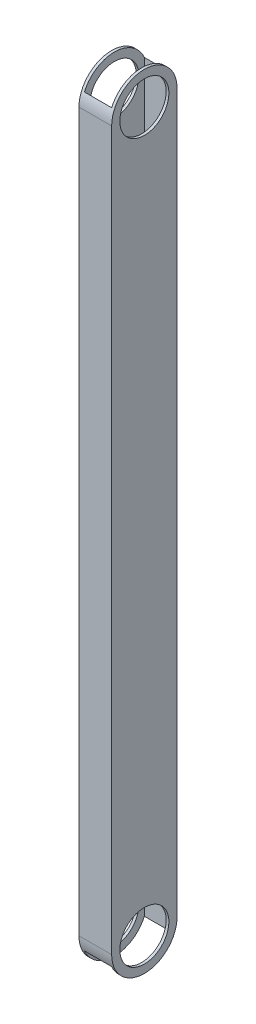
ISO-10303-21;
HEADER;
FILE_DESCRIPTION(('STEP AP214'),'2;1');
FILE_NAME('part.step','',(''),(''),'','','');
FILE_SCHEMA(('AUTOMOTIVE_DESIGN { 1 0 10303 214 1 1 1 1 }'));
ENDSEC;
DATA;
#1=APPLICATION_CONTEXT('core data for automotive mechanical design processes');
#2=APPLICATION_PROTOCOL_DEFINITION('international standard','automotive_design',2000,#1);
#3=PRODUCT_CONTEXT('',#1,'mechanical');
#4=PRODUCT('Part','Part','',(#3));
#5=PRODUCT_RELATED_PRODUCT_CATEGORY('part','',(#4));
#6=PRODUCT_DEFINITION_FORMATION('','',#4);
#7=PRODUCT_DEFINITION_CONTEXT('part definition',#1,'design');
#8=PRODUCT_DEFINITION('design','',#6,#7);
#9=PRODUCT_DEFINITION_SHAPE('','',#8);
#10=(LENGTH_UNIT() NAMED_UNIT(*) SI_UNIT(.MILLI.,.METRE.));
#11=(NAMED_UNIT(*) PLANE_ANGLE_UNIT() SI_UNIT($,.RADIAN.));
#12=(NAMED_UNIT(*) SI_UNIT($,.STERADIAN.) SOLID_ANGLE_UNIT());
#13=UNCERTAINTY_MEASURE_WITH_UNIT(LENGTH_MEASURE(1.E-05),#10,'distance_accuracy_value','');
#14=(GEOMETRIC_REPRESENTATION_CONTEXT(3) GLOBAL_UNCERTAINTY_ASSIGNED_CONTEXT((#13)) GLOBAL_UNIT_ASSIGNED_CONTEXT((#10,
#11,#12)) REPRESENTATION_CONTEXT('',''));
#15=CARTESIAN_POINT('',(0.,0.,0.));
#16=DIRECTION('',(0.,0.,1.));
#17=DIRECTION('',(1.,0.,0.));
#18=AXIS2_PLACEMENT_3D('',#15,#16,#17);
#19=CARTESIAN_POINT('',(0.,456.184,0.));
#20=DIRECTION('',(1.,0.,0.));
#21=DIRECTION('',(0.,0.,-1.));
#22=AXIS2_PLACEMENT_3D('',#19,#20,#21);
#23=PLANE('',#22);
#24=CARTESIAN_POINT('',(0.,437.134,-19.05));
#25=DIRECTION('',(-1.,0.,0.));
#26=DIRECTION('',(0.,0.,1.));
#27=AXIS2_PLACEMENT_3D('',#24,#25,#26);
#28=CIRCLE('',#27,14.2875);
#29=CARTESIAN_POINT('',(0.,437.134,-4.76250000000001));
#30=VERTEX_POINT('',#29);
#31=EDGE_CURVE('E216',#30,#30,#28,.T.);
#32=ORIENTED_EDGE('',*,*,#31,.F.);
#33=EDGE_LOOP('',(#32));
#34=FACE_BOUND('',#33,.T.);
#35=CARTESIAN_POINT('',(0.,19.05,-19.05));
#36=DIRECTION('',(-1.,0.,0.));
#37=DIRECTION('',(0.,0.,1.));
#38=AXIS2_PLACEMENT_3D('',#35,#36,#37);
#39=CIRCLE('',#38,14.2875);
#40=CARTESIAN_POINT('',(0.,19.05,-4.7625));
#41=VERTEX_POINT('',#40);
#42=EDGE_CURVE('E240',#41,#41,#39,.T.);
#43=ORIENTED_EDGE('',*,*,#42,.F.);
#44=EDGE_LOOP('',(#43));
#45=FACE_BOUND('',#44,.T.);
#46=DIRECTION('',(0.,-1.,0.));
#47=VECTOR('',#46,1.);
#48=CARTESIAN_POINT('',(0.,456.184,0.));
#49=LINE('',#48,#47);
#50=CARTESIAN_POINT('',(0.,437.134,0.));
#51=VERTEX_POINT('',#50);
#52=CARTESIAN_POINT('',(0.,19.05,0.));
#53=VERTEX_POINT('',#52);
#54=EDGE_CURVE('E191',#51,#53,#49,.T.);
#55=ORIENTED_EDGE('',*,*,#54,.F.);
#56=CARTESIAN_POINT('',(0.,437.134,-19.05));
#57=DIRECTION('',(-1.,0.,0.));
#58=DIRECTION('',(0.,0.,1.));
#59=AXIS2_PLACEMENT_3D('',#56,#57,#58);
#60=CIRCLE('',#59,19.05);
#61=CARTESIAN_POINT('',(0.,437.134,-38.1));
#62=VERTEX_POINT('',#61);
#63=EDGE_CURVE('E177',#51,#62,#60,.T.);
#64=ORIENTED_EDGE('',*,*,#63,.T.);
#65=DIRECTION('',(0.,-1.,0.));
#66=VECTOR('',#65,1.);
#67=CARTESIAN_POINT('',(0.,456.184,-38.1));
#68=LINE('',#67,#66);
#69=CARTESIAN_POINT('',(0.,19.05,-38.1));
#70=VERTEX_POINT('',#69);
#71=EDGE_CURVE('E195',#62,#70,#68,.T.);
#72=ORIENTED_EDGE('',*,*,#71,.T.);
#73=CARTESIAN_POINT('',(0.,19.05,-19.05));
#74=DIRECTION('',(-1.,0.,0.));
#75=DIRECTION('',(0.,0.,1.));
#76=AXIS2_PLACEMENT_3D('',#73,#74,#75);
#77=CIRCLE('',#76,19.05);
#78=EDGE_CURVE('E227',#70,#53,#77,.T.);
#79=ORIENTED_EDGE('',*,*,#78,.T.);
#80=EDGE_LOOP('',(#55,#64,#72,#79));
#81=FACE_BOUND('',#80,.T.);
#82=ADVANCED_FACE('F105',(#34,#45,#81),#23,.F.);
#83=CARTESIAN_POINT('',(19.05,456.184,0.));
#84=DIRECTION('',(-1.,0.,0.));
#85=DIRECTION('',(0.,0.,1.));
#86=AXIS2_PLACEMENT_3D('',#83,#84,#85);
#87=PLANE('',#86);
#88=CARTESIAN_POINT('',(19.05,437.134,-19.05));
#89=DIRECTION('',(-1.,0.,0.));
#90=DIRECTION('',(0.,0.,1.));
#91=AXIS2_PLACEMENT_3D('',#88,#89,#90);
#92=CIRCLE('',#91,14.2875);
#93=CARTESIAN_POINT('',(19.05,437.134,-4.76250000000001));
#94=VERTEX_POINT('',#93);
#95=EDGE_CURVE('E210',#94,#94,#92,.T.);
#96=ORIENTED_EDGE('',*,*,#95,.T.);
#97=EDGE_LOOP('',(#96));
#98=FACE_BOUND('',#97,.T.);
#99=CARTESIAN_POINT('',(19.05,19.05,-19.05));
#100=DIRECTION('',(-1.,0.,0.));
#101=DIRECTION('',(0.,0.,1.));
#102=AXIS2_PLACEMENT_3D('',#99,#100,#101);
#103=CIRCLE('',#102,14.2875);
#104=CARTESIAN_POINT('',(19.05,19.05,-4.7625));
#105=VERTEX_POINT('',#104);
#106=EDGE_CURVE('E203',#105,#105,#103,.T.);
#107=ORIENTED_EDGE('',*,*,#106,.T.);
#108=EDGE_LOOP('',(#107));
#109=FACE_BOUND('',#108,.T.);
#110=CARTESIAN_POINT('',(19.05,437.134,-19.05));
#111=DIRECTION('',(-1.,0.,0.));
#112=DIRECTION('',(0.,0.,1.));
#113=AXIS2_PLACEMENT_3D('',#110,#111,#112);
#114=CIRCLE('',#113,19.05);
#115=CARTESIAN_POINT('',(19.05,437.134,0.));
#116=VERTEX_POINT('',#115);
#117=CARTESIAN_POINT('',(19.05,437.134,-38.1));
#118=VERTEX_POINT('',#117);
#119=EDGE_CURVE('E119',#116,#118,#114,.T.);
#120=ORIENTED_EDGE('',*,*,#119,.F.);
#121=DIRECTION('',(0.,-1.,0.));
#122=VECTOR('',#121,1.);
#123=CARTESIAN_POINT('',(19.05,456.184,0.));
#124=LINE('',#123,#122);
#125=CARTESIAN_POINT('',(19.05,19.05,0.));
#126=VERTEX_POINT('',#125);
#127=EDGE_CURVE('E173',#116,#126,#124,.T.);
#128=ORIENTED_EDGE('',*,*,#127,.T.);
#129=CARTESIAN_POINT('',(19.05,19.05,-19.05));
#130=DIRECTION('',(-1.,0.,0.));
#131=DIRECTION('',(0.,0.,1.));
#132=AXIS2_PLACEMENT_3D('',#129,#130,#131);
#133=CIRCLE('',#132,19.05);
#134=CARTESIAN_POINT('',(19.05,19.05,-38.1));
#135=VERTEX_POINT('',#134);
#136=EDGE_CURVE('E228',#135,#126,#133,.T.);
#137=ORIENTED_EDGE('',*,*,#136,.F.);
#138=DIRECTION('',(0.,-1.,0.));
#139=VECTOR('',#138,1.);
#140=CARTESIAN_POINT('',(19.05,456.184,-38.1));
#141=LINE('',#140,#139);
#142=EDGE_CURVE('E175',#118,#135,#141,.T.);
#143=ORIENTED_EDGE('',*,*,#142,.F.);
#144=EDGE_LOOP('',(#120,#128,#137,#143));
#145=FACE_BOUND('',#144,.T.);
#146=ADVANCED_FACE('F170',(#98,#109,#145),#87,.F.);
#147=CARTESIAN_POINT('',(1.5875,456.184,0.));
#148=DIRECTION('',(1.,0.,0.));
#149=DIRECTION('',(0.,0.,-1.));
#150=AXIS2_PLACEMENT_3D('',#147,#148,#149);
#151=PLANE('',#150);
#152=CARTESIAN_POINT('',(1.5875,437.134,-19.05));
#153=DIRECTION('',(1.,0.,0.));
#154=DIRECTION('',(0.,0.,-1.));
#155=AXIS2_PLACEMENT_3D('',#152,#153,#154);
#156=CIRCLE('',#155,14.2875);
#157=CARTESIAN_POINT('',(1.5875,437.134,-33.3375));
#158=VERTEX_POINT('',#157);
#159=EDGE_CURVE('E209',#158,#158,#156,.T.);
#160=ORIENTED_EDGE('',*,*,#159,.F.);
#161=EDGE_LOOP('',(#160));
#162=FACE_BOUND('',#161,.T.);
#163=CARTESIAN_POINT('',(1.5875,19.05,-19.05));
#164=DIRECTION('',(1.,0.,0.));
#165=DIRECTION('',(0.,0.,-1.));
#166=AXIS2_PLACEMENT_3D('',#163,#164,#165);
#167=CIRCLE('',#166,14.2875);
#168=CARTESIAN_POINT('',(1.5875,19.05,-33.3375));
#169=VERTEX_POINT('',#168);
#170=EDGE_CURVE('E202',#169,#169,#167,.T.);
#171=ORIENTED_EDGE('',*,*,#170,.F.);
#172=EDGE_LOOP('',(#171));
#173=FACE_BOUND('',#172,.T.);
#174=CARTESIAN_POINT('',(1.5875,437.134,-19.05));
#175=DIRECTION('',(1.,0.,0.));
#176=DIRECTION('',(0.,0.,-1.));
#177=AXIS2_PLACEMENT_3D('',#174,#175,#176);
#178=CIRCLE('',#177,19.05);
#179=CARTESIAN_POINT('',(1.5875,444.747382543259,-36.5125));
#180=VERTEX_POINT('',#179);
#181=CARTESIAN_POINT('',(1.5875,444.747382543259,-1.58750000000001));
#182=VERTEX_POINT('',#181);
#183=EDGE_CURVE('E221',#180,#182,#178,.T.);
#184=ORIENTED_EDGE('',*,*,#183,.T.);
#185=DIRECTION('',(0.,-1.,0.));
#186=VECTOR('',#185,1.);
#187=CARTESIAN_POINT('',(1.5875,456.184,-1.5875));
#188=LINE('',#187,#186);
#189=CARTESIAN_POINT('',(1.5875,11.4366174567411,-1.58750000000001));
#190=VERTEX_POINT('',#189);
#191=EDGE_CURVE('E252',#182,#190,#188,.T.);
#192=ORIENTED_EDGE('',*,*,#191,.T.);
#193=CARTESIAN_POINT('',(1.5875,19.05,-19.05));
#194=DIRECTION('',(1.,0.,0.));
#195=DIRECTION('',(0.,0.,-1.));
#196=AXIS2_PLACEMENT_3D('',#193,#194,#195);
#197=CIRCLE('',#196,19.05);
#198=CARTESIAN_POINT('',(1.5875,11.4366174567411,-36.5125));
#199=VERTEX_POINT('',#198);
#200=EDGE_CURVE('E237',#190,#199,#197,.T.);
#201=ORIENTED_EDGE('',*,*,#200,.T.);
#202=DIRECTION('',(0.,-1.,0.));
#203=VECTOR('',#202,1.);
#204=CARTESIAN_POINT('',(1.5875,456.184,-36.5125));
#205=LINE('',#204,#203);
#206=EDGE_CURVE('E247',#180,#199,#205,.T.);
#207=ORIENTED_EDGE('',*,*,#206,.F.);
#208=EDGE_LOOP('',(#184,#192,#201,#207));
#209=FACE_BOUND('',#208,.T.);
#210=ADVANCED_FACE('F272',(#162,#173,#209),#151,.T.);
#211=CARTESIAN_POINT('',(17.4625,456.184,0.));
#212=DIRECTION('',(-1.,0.,0.));
#213=DIRECTION('',(0.,0.,1.));
#214=AXIS2_PLACEMENT_3D('',#211,#212,#213);
#215=PLANE('',#214);
#216=CARTESIAN_POINT('',(17.4625,437.134,-19.05));
#217=DIRECTION('',(-1.,0.,0.));
#218=DIRECTION('',(0.,0.,1.));
#219=AXIS2_PLACEMENT_3D('',#216,#217,#218);
#220=CIRCLE('',#219,14.2875);
#221=CARTESIAN_POINT('',(17.4625,437.134,-4.76250000000001));
#222=VERTEX_POINT('',#221);
#223=EDGE_CURVE('E207',#222,#222,#220,.T.);
#224=ORIENTED_EDGE('',*,*,#223,.F.);
#225=EDGE_LOOP('',(#224));
#226=FACE_BOUND('',#225,.T.);
#227=CARTESIAN_POINT('',(17.4625,19.05,-19.05));
#228=DIRECTION('',(-1.,0.,0.));
#229=DIRECTION('',(0.,0.,1.));
#230=AXIS2_PLACEMENT_3D('',#227,#228,#229);
#231=CIRCLE('',#230,14.2875);
#232=CARTESIAN_POINT('',(17.4625,19.05,-4.7625));
#233=VERTEX_POINT('',#232);
#234=EDGE_CURVE('E199',#233,#233,#231,.T.);
#235=ORIENTED_EDGE('',*,*,#234,.F.);
#236=EDGE_LOOP('',(#235));
#237=FACE_BOUND('',#236,.T.);
#238=DIRECTION('',(0.,-1.,0.));
#239=VECTOR('',#238,1.);
#240=CARTESIAN_POINT('',(17.4625,456.184,-1.5875));
#241=LINE('',#240,#239);
#242=CARTESIAN_POINT('',(17.4625,444.747382543259,-1.58750000000001));
#243=VERTEX_POINT('',#242);
#244=CARTESIAN_POINT('',(17.4625,11.4366174567411,-1.58750000000001));
#245=VERTEX_POINT('',#244);
#246=EDGE_CURVE('E250',#243,#245,#241,.T.);
#247=ORIENTED_EDGE('',*,*,#246,.F.);
#248=CARTESIAN_POINT('',(17.4625,437.134,-19.05));
#249=DIRECTION('',(-1.,0.,0.));
#250=DIRECTION('',(0.,0.,1.));
#251=AXIS2_PLACEMENT_3D('',#248,#249,#250);
#252=CIRCLE('',#251,19.05);
#253=CARTESIAN_POINT('',(17.4625,444.747382543259,-36.5125));
#254=VERTEX_POINT('',#253);
#255=EDGE_CURVE('E265',#243,#254,#252,.T.);
#256=ORIENTED_EDGE('',*,*,#255,.T.);
#257=DIRECTION('',(0.,-1.,0.));
#258=VECTOR('',#257,1.);
#259=CARTESIAN_POINT('',(17.4625,456.184,-36.5125));
#260=LINE('',#259,#258);
#261=CARTESIAN_POINT('',(17.4625,11.4366174567412,-36.5125));
#262=VERTEX_POINT('',#261);
#263=EDGE_CURVE('E127',#254,#262,#260,.T.);
#264=ORIENTED_EDGE('',*,*,#263,.T.);
#265=CARTESIAN_POINT('',(17.4625,19.05,-19.05));
#266=DIRECTION('',(-1.,0.,0.));
#267=DIRECTION('',(0.,0.,1.));
#268=AXIS2_PLACEMENT_3D('',#265,#266,#267);
#269=CIRCLE('',#268,19.05);
#270=EDGE_CURVE('E235',#262,#245,#269,.T.);
#271=ORIENTED_EDGE('',*,*,#270,.T.);
#272=EDGE_LOOP('',(#247,#256,#264,#271));
#273=FACE_BOUND('',#272,.T.);
#274=ADVANCED_FACE('F288',(#226,#237,#273),#215,.T.);
#275=CARTESIAN_POINT('',(0.,456.184,-1.5875));
#276=DIRECTION('',(0.,0.,-1.));
#277=DIRECTION('',(-1.,0.,0.));
#278=AXIS2_PLACEMENT_3D('',#275,#276,#277);
#279=PLANE('',#278);
#280=ORIENTED_EDGE('',*,*,#191,.F.);
#281=DIRECTION('',(-1.,0.,0.));
#282=VECTOR('',#281,1.);
#283=CARTESIAN_POINT('',(19.05,444.747382543259,-1.58750000000001));
#284=LINE('',#283,#282);
#285=EDGE_CURVE('E12',#182,#243,#284,.F.);
#286=ORIENTED_EDGE('',*,*,#285,.T.);
#287=ORIENTED_EDGE('',*,*,#246,.T.);
#288=DIRECTION('',(-1.,0.,0.));
#289=VECTOR('',#288,1.);
#290=CARTESIAN_POINT('',(19.05,11.4366174567411,-1.58750000000001));
#291=LINE('',#290,#289);
#292=EDGE_CURVE('E112',#245,#190,#291,.T.);
#293=ORIENTED_EDGE('',*,*,#292,.T.);
#294=EDGE_LOOP('',(#280,#286,#287,#293));
#295=FACE_BOUND('',#294,.T.);
#296=ADVANCED_FACE('F276',(#295),#279,.T.);
#297=CARTESIAN_POINT('',(0.,456.184,-36.5125));
#298=DIRECTION('',(0.,0.,1.));
#299=DIRECTION('',(1.,0.,0.));
#300=AXIS2_PLACEMENT_3D('',#297,#298,#299);
#301=PLANE('',#300);
#302=ORIENTED_EDGE('',*,*,#263,.F.);
#303=DIRECTION('',(-1.,0.,0.));
#304=VECTOR('',#303,1.);
#305=CARTESIAN_POINT('',(19.05,444.747382543259,-36.5125));
#306=LINE('',#305,#304);
#307=EDGE_CURVE('E262',#254,#180,#306,.T.);
#308=ORIENTED_EDGE('',*,*,#307,.T.);
#309=ORIENTED_EDGE('',*,*,#206,.T.);
#310=DIRECTION('',(-1.,0.,0.));
#311=VECTOR('',#310,1.);
#312=CARTESIAN_POINT('',(19.05,11.4366174567411,-36.5125));
#313=LINE('',#312,#311);
#314=EDGE_CURVE('E193',#199,#262,#313,.F.);
#315=ORIENTED_EDGE('',*,*,#314,.T.);
#316=EDGE_LOOP('',(#302,#308,#309,#315));
#317=FACE_BOUND('',#316,.T.);
#318=ADVANCED_FACE('F280',(#317),#301,.T.);
#319=CARTESIAN_POINT('',(0.,456.184,-38.1));
#320=DIRECTION('',(0.,0.,1.));
#321=DIRECTION('',(1.,0.,0.));
#322=AXIS2_PLACEMENT_3D('',#319,#320,#321);
#323=PLANE('',#322);
#324=DIRECTION('',(-1.,0.,0.));
#325=VECTOR('',#324,1.);
#326=CARTESIAN_POINT('',(19.05,437.134,-38.1));
#327=LINE('',#326,#325);
#328=EDGE_CURVE('E176',#118,#62,#327,.T.);
#329=ORIENTED_EDGE('',*,*,#328,.F.);
#330=ORIENTED_EDGE('',*,*,#142,.T.);
#331=DIRECTION('',(-1.,0.,0.));
#332=VECTOR('',#331,1.);
#333=CARTESIAN_POINT('',(19.05,19.05,-38.1));
#334=LINE('',#333,#332);
#335=EDGE_CURVE('E230',#135,#70,#334,.T.);
#336=ORIENTED_EDGE('',*,*,#335,.T.);
#337=ORIENTED_EDGE('',*,*,#71,.F.);
#338=EDGE_LOOP('',(#329,#330,#336,#337));
#339=FACE_BOUND('',#338,.T.);
#340=ADVANCED_FACE('F261',(#339),#323,.F.);
#341=CARTESIAN_POINT('',(0.,456.184,0.));
#342=DIRECTION('',(0.,0.,-1.));
#343=DIRECTION('',(-1.,0.,0.));
#344=AXIS2_PLACEMENT_3D('',#341,#342,#343);
#345=PLANE('',#344);
#346=ORIENTED_EDGE('',*,*,#127,.F.);
#347=DIRECTION('',(-1.,0.,0.));
#348=VECTOR('',#347,1.);
#349=CARTESIAN_POINT('',(19.05,437.134,0.));
#350=LINE('',#349,#348);
#351=EDGE_CURVE('E180',#116,#51,#350,.T.);
#352=ORIENTED_EDGE('',*,*,#351,.T.);
#353=ORIENTED_EDGE('',*,*,#54,.T.);
#354=DIRECTION('',(-1.,0.,0.));
#355=VECTOR('',#354,1.);
#356=CARTESIAN_POINT('',(19.05,19.05,0.));
#357=LINE('',#356,#355);
#358=EDGE_CURVE('E190',#126,#53,#357,.T.);
#359=ORIENTED_EDGE('',*,*,#358,.F.);
#360=EDGE_LOOP('',(#346,#352,#353,#359));
#361=FACE_BOUND('',#360,.T.);
#362=ADVANCED_FACE('F188',(#361),#345,.F.);
#363=CARTESIAN_POINT('',(19.05,19.05,-19.05));
#364=DIRECTION('',(-1.,0.,0.));
#365=DIRECTION('',(0.,0.,1.));
#366=AXIS2_PLACEMENT_3D('',#363,#364,#365);
#367=CYLINDRICAL_SURFACE('',#366,14.2875);
#368=ORIENTED_EDGE('',*,*,#234,.T.);
#369=EDGE_LOOP('',(#368));
#370=FACE_BOUND('',#369,.T.);
#371=ORIENTED_EDGE('',*,*,#106,.F.);
#372=EDGE_LOOP('',(#371));
#373=FACE_BOUND('',#372,.T.);
#374=ADVANCED_FACE('F304',(#370,#373),#367,.F.);
#375=ORIENTED_EDGE('',*,*,#170,.T.);
#376=EDGE_LOOP('',(#375));
#377=FACE_BOUND('',#376,.T.);
#378=ORIENTED_EDGE('',*,*,#42,.T.);
#379=EDGE_LOOP('',(#378));
#380=FACE_BOUND('',#379,.T.);
#381=ADVANCED_FACE('F302',(#377,#380),#367,.F.);
#382=CARTESIAN_POINT('',(19.05,19.05,-19.05));
#383=DIRECTION('',(-1.,0.,0.));
#384=DIRECTION('',(0.,0.,1.));
#385=AXIS2_PLACEMENT_3D('',#382,#383,#384);
#386=CYLINDRICAL_SURFACE('',#385,19.05);
#387=ORIENTED_EDGE('',*,*,#358,.T.);
#388=ORIENTED_EDGE('',*,*,#78,.F.);
#389=ORIENTED_EDGE('',*,*,#335,.F.);
#390=ORIENTED_EDGE('',*,*,#136,.T.);
#391=EDGE_LOOP('',(#387,#388,#389,#390));
#392=FACE_BOUND('',#391,.T.);
#393=ORIENTED_EDGE('',*,*,#200,.F.);
#394=ORIENTED_EDGE('',*,*,#292,.F.);
#395=ORIENTED_EDGE('',*,*,#270,.F.);
#396=ORIENTED_EDGE('',*,*,#314,.F.);
#397=EDGE_LOOP('',(#393,#394,#395,#396));
#398=FACE_BOUND('',#397,.T.);
#399=ADVANCED_FACE('F259',(#392,#398),#386,.T.);
#400=CARTESIAN_POINT('',(19.05,437.134,-19.05));
#401=DIRECTION('',(-1.,0.,0.));
#402=DIRECTION('',(0.,0.,1.));
#403=AXIS2_PLACEMENT_3D('',#400,#401,#402);
#404=CYLINDRICAL_SURFACE('',#403,14.2875);
#405=ORIENTED_EDGE('',*,*,#223,.T.);
#406=EDGE_LOOP('',(#405));
#407=FACE_BOUND('',#406,.T.);
#408=ORIENTED_EDGE('',*,*,#95,.F.);
#409=EDGE_LOOP('',(#408));
#410=FACE_BOUND('',#409,.T.);
#411=ADVANCED_FACE('F310',(#407,#410),#404,.F.);
#412=ORIENTED_EDGE('',*,*,#159,.T.);
#413=EDGE_LOOP('',(#412));
#414=FACE_BOUND('',#413,.T.);
#415=ORIENTED_EDGE('',*,*,#31,.T.);
#416=EDGE_LOOP('',(#415));
#417=FACE_BOUND('',#416,.T.);
#418=ADVANCED_FACE('F316',(#414,#417),#404,.F.);
#419=CARTESIAN_POINT('',(19.05,437.134,-19.05));
#420=DIRECTION('',(-1.,0.,0.));
#421=DIRECTION('',(0.,0.,1.));
#422=AXIS2_PLACEMENT_3D('',#419,#420,#421);
#423=CYLINDRICAL_SURFACE('',#422,19.05);
#424=ORIENTED_EDGE('',*,*,#63,.F.);
#425=ORIENTED_EDGE('',*,*,#351,.F.);
#426=ORIENTED_EDGE('',*,*,#119,.T.);
#427=ORIENTED_EDGE('',*,*,#328,.T.);
#428=EDGE_LOOP('',(#424,#425,#426,#427));
#429=FACE_BOUND('',#428,.T.);
#430=ORIENTED_EDGE('',*,*,#307,.F.);
#431=ORIENTED_EDGE('',*,*,#255,.F.);
#432=ORIENTED_EDGE('',*,*,#285,.F.);
#433=ORIENTED_EDGE('',*,*,#183,.F.);
#434=EDGE_LOOP('',(#430,#431,#432,#433));
#435=FACE_BOUND('',#434,.T.);
#436=ADVANCED_FACE('F181',(#429,#435),#423,.T.);
#437=CLOSED_SHELL('',(#82,#146,#210,#274,#296,#318,#340,#362,#374,#381,#399,#411,#418,#436));
#438=MANIFOLD_SOLID_BREP('B2',#437);
#439=ADVANCED_BREP_SHAPE_REPRESENTATION('',(#18,#438),#14);
#440=SHAPE_DEFINITION_REPRESENTATION(#9,#439);
ENDSEC;
END-ISO-10303-21;
